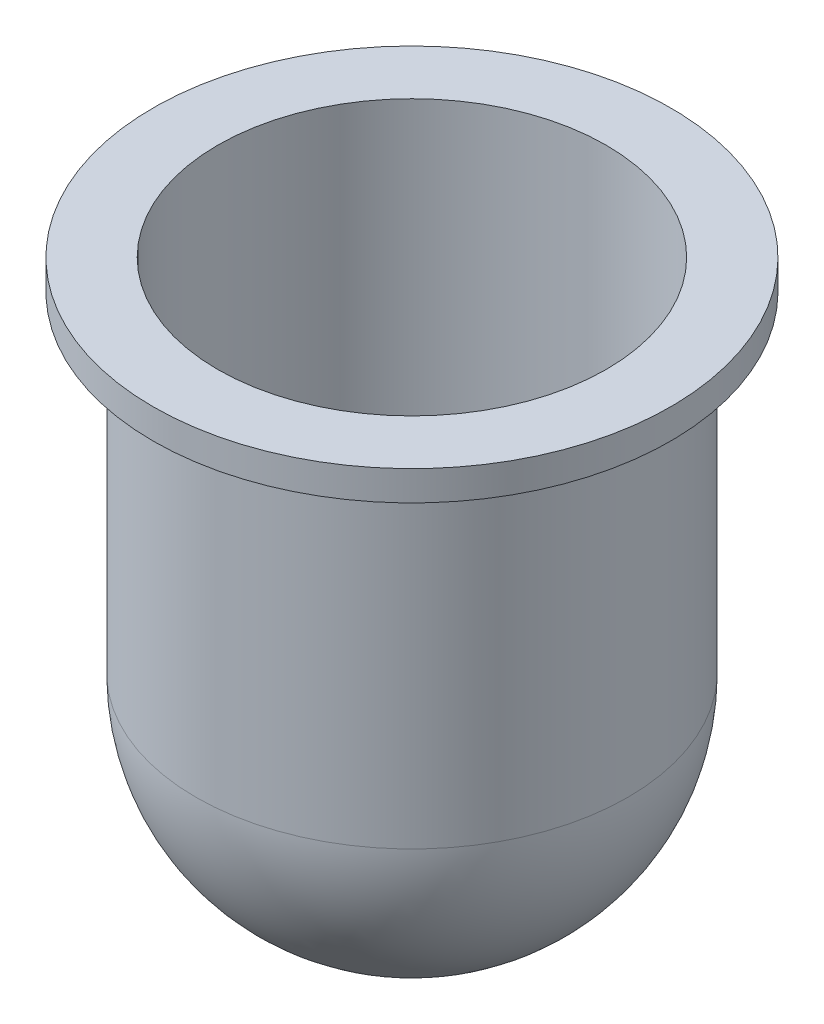
ISO-10303-21;
HEADER;
FILE_DESCRIPTION(('STEP AP214'),'2;1');
FILE_NAME('part.step','',(''),(''),'','','');
FILE_SCHEMA(('AUTOMOTIVE_DESIGN { 1 0 10303 214 1 1 1 1 }'));
ENDSEC;
DATA;
#1=APPLICATION_CONTEXT('core data for automotive mechanical design processes');
#2=APPLICATION_PROTOCOL_DEFINITION('international standard','automotive_design',2000,#1);
#3=PRODUCT_CONTEXT('',#1,'mechanical');
#4=PRODUCT('Part','Part','',(#3));
#5=PRODUCT_RELATED_PRODUCT_CATEGORY('part','',(#4));
#6=PRODUCT_DEFINITION_FORMATION('','',#4);
#7=PRODUCT_DEFINITION_CONTEXT('part definition',#1,'design');
#8=PRODUCT_DEFINITION('design','',#6,#7);
#9=PRODUCT_DEFINITION_SHAPE('','',#8);
#10=(LENGTH_UNIT() NAMED_UNIT(*) SI_UNIT(.MILLI.,.METRE.));
#11=(NAMED_UNIT(*) PLANE_ANGLE_UNIT() SI_UNIT($,.RADIAN.));
#12=(NAMED_UNIT(*) SI_UNIT($,.STERADIAN.) SOLID_ANGLE_UNIT());
#13=UNCERTAINTY_MEASURE_WITH_UNIT(LENGTH_MEASURE(1.E-05),#10,'distance_accuracy_value','');
#14=(GEOMETRIC_REPRESENTATION_CONTEXT(3) GLOBAL_UNCERTAINTY_ASSIGNED_CONTEXT((#13)) GLOBAL_UNIT_ASSIGNED_CONTEXT((#10,
#11,#12)) REPRESENTATION_CONTEXT('',''));
#15=CARTESIAN_POINT('',(0.,0.,0.));
#16=DIRECTION('',(0.,0.,1.));
#17=DIRECTION('',(1.,0.,0.));
#18=AXIS2_PLACEMENT_3D('',#15,#16,#17);
#19=CARTESIAN_POINT('',(0.,107.077522154684,0.));
#20=DIRECTION('',(0.,1.,0.));
#21=DIRECTION('',(0.,0.,1.));
#22=AXIS2_PLACEMENT_3D('',#19,#20,#21);
#23=CYLINDRICAL_SURFACE('',#22,17.9857628043161);
#24=CARTESIAN_POINT('',(0.,37.9355682328204,0.));
#25=DIRECTION('',(0.,1.,0.));
#26=DIRECTION('',(0.,0.,1.));
#27=AXIS2_PLACEMENT_3D('',#24,#25,#26);
#28=CIRCLE('',#27,17.9857628043161);
#29=CARTESIAN_POINT('',(0.,37.9355682328204,17.9857628043161));
#30=VERTEX_POINT('',#29);
#31=EDGE_CURVE('E40',#30,#30,#28,.T.);
#32=ORIENTED_EDGE('',*,*,#31,.T.);
#33=EDGE_LOOP('',(#32));
#34=FACE_BOUND('',#33,.T.);
#35=CARTESIAN_POINT('',(0.,40.,0.));
#36=DIRECTION('',(0.,1.,0.));
#37=DIRECTION('',(0.,0.,1.));
#38=AXIS2_PLACEMENT_3D('',#35,#36,#37);
#39=CIRCLE('',#38,17.9857628043161);
#40=CARTESIAN_POINT('',(0.,40.,17.9857628043161));
#41=VERTEX_POINT('',#40);
#42=EDGE_CURVE('E10',#41,#41,#39,.T.);
#43=ORIENTED_EDGE('',*,*,#42,.F.);
#44=EDGE_LOOP('',(#43));
#45=FACE_BOUND('',#44,.T.);
#46=ADVANCED_FACE('F34',(#34,#45),#23,.T.);
#47=CARTESIAN_POINT('',(-17.9857628043161,37.9355682328204,0.));
#48=DIRECTION('',(0.,-1.,0.));
#49=DIRECTION('',(0.,0.,-1.));
#50=AXIS2_PLACEMENT_3D('',#47,#48,#49);
#51=PLANE('',#50);
#52=CARTESIAN_POINT('',(0.,37.9355682328204,0.));
#53=DIRECTION('',(0.,1.,0.));
#54=DIRECTION('',(0.,0.,1.));
#55=AXIS2_PLACEMENT_3D('',#52,#53,#54);
#56=CIRCLE('',#55,15.);
#57=CARTESIAN_POINT('',(0.,37.9355682328204,15.));
#58=VERTEX_POINT('',#57);
#59=EDGE_CURVE('E44',#58,#58,#56,.T.);
#60=ORIENTED_EDGE('',*,*,#59,.T.);
#61=EDGE_LOOP('',(#60));
#62=FACE_BOUND('',#61,.T.);
#63=ORIENTED_EDGE('',*,*,#31,.F.);
#64=EDGE_LOOP('',(#63));
#65=FACE_BOUND('',#64,.T.);
#66=ADVANCED_FACE('F72',(#62,#65),#51,.T.);
#67=CARTESIAN_POINT('',(0.,107.077522154684,0.));
#68=DIRECTION('',(0.,1.,0.));
#69=DIRECTION('',(0.,0.,1.));
#70=AXIS2_PLACEMENT_3D('',#67,#68,#69);
#71=CYLINDRICAL_SURFACE('',#70,15.);
#72=CARTESIAN_POINT('',(0.,15.,0.));
#73=DIRECTION('',(0.,1.,0.));
#74=DIRECTION('',(0.,0.,1.));
#75=AXIS2_PLACEMENT_3D('',#72,#73,#74);
#76=CIRCLE('',#75,15.);
#77=CARTESIAN_POINT('',(0.,15.,15.));
#78=VERTEX_POINT('',#77);
#79=EDGE_CURVE('E48',#78,#78,#76,.T.);
#80=ORIENTED_EDGE('',*,*,#79,.T.);
#81=EDGE_LOOP('',(#80));
#82=FACE_BOUND('',#81,.T.);
#83=ORIENTED_EDGE('',*,*,#59,.F.);
#84=EDGE_LOOP('',(#83));
#85=FACE_BOUND('',#84,.T.);
#86=ADVANCED_FACE('F76',(#82,#85),#71,.T.);
#87=CARTESIAN_POINT('',(0.,15.,0.));
#88=DIRECTION('',(0.,1.,0.));
#89=DIRECTION('',(-1.,0.,0.));
#90=AXIS2_PLACEMENT_3D('',#87,#88,#89);
#91=SPHERICAL_SURFACE('',#90,15.);
#92=ORIENTED_EDGE('',*,*,#79,.F.);
#93=EDGE_LOOP('',(#92));
#94=FACE_BOUND('',#93,.T.);
#95=ADVANCED_FACE('F82',(#94),#91,.T.);
#96=CARTESIAN_POINT('',(0.,15.,0.));
#97=DIRECTION('',(0.,1.,0.));
#98=DIRECTION('',(-1.,0.,0.));
#99=AXIS2_PLACEMENT_3D('',#96,#97,#98);
#100=SPHERICAL_SURFACE('',#99,13.5);
#101=CARTESIAN_POINT('',(0.,15.,0.));
#102=DIRECTION('',(0.,1.,0.));
#103=DIRECTION('',(0.,0.,1.));
#104=AXIS2_PLACEMENT_3D('',#101,#102,#103);
#105=CIRCLE('',#104,13.5);
#106=CARTESIAN_POINT('',(0.,15.,13.5));
#107=VERTEX_POINT('',#106);
#108=EDGE_CURVE('E53',#107,#107,#105,.T.);
#109=ORIENTED_EDGE('',*,*,#108,.T.);
#110=EDGE_LOOP('',(#109));
#111=FACE_BOUND('',#110,.T.);
#112=ADVANCED_FACE('F69',(#111),#100,.F.);
#113=CARTESIAN_POINT('',(0.,107.077522154684,0.));
#114=DIRECTION('',(0.,1.,0.));
#115=DIRECTION('',(0.,0.,1.));
#116=AXIS2_PLACEMENT_3D('',#113,#114,#115);
#117=CYLINDRICAL_SURFACE('',#116,13.5);
#118=CARTESIAN_POINT('',(0.,40.,0.));
#119=DIRECTION('',(0.,1.,0.));
#120=DIRECTION('',(0.,0.,1.));
#121=AXIS2_PLACEMENT_3D('',#118,#119,#120);
#122=CIRCLE('',#121,13.5);
#123=CARTESIAN_POINT('',(0.,40.,13.5));
#124=VERTEX_POINT('',#123);
#125=EDGE_CURVE('E56',#124,#124,#122,.T.);
#126=ORIENTED_EDGE('',*,*,#125,.T.);
#127=EDGE_LOOP('',(#126));
#128=FACE_BOUND('',#127,.T.);
#129=ORIENTED_EDGE('',*,*,#108,.F.);
#130=EDGE_LOOP('',(#129));
#131=FACE_BOUND('',#130,.T.);
#132=ADVANCED_FACE('F60',(#128,#131),#117,.F.);
#133=CARTESIAN_POINT('',(-15.,40.,0.));
#134=DIRECTION('',(0.,1.,0.));
#135=DIRECTION('',(0.,0.,1.));
#136=AXIS2_PLACEMENT_3D('',#133,#134,#135);
#137=PLANE('',#136);
#138=ORIENTED_EDGE('',*,*,#42,.T.);
#139=EDGE_LOOP('',(#138));
#140=FACE_BOUND('',#139,.T.);
#141=ORIENTED_EDGE('',*,*,#125,.F.);
#142=EDGE_LOOP('',(#141));
#143=FACE_BOUND('',#142,.T.);
#144=ADVANCED_FACE('F63',(#140,#143),#137,.T.);
#145=CLOSED_SHELL('',(#46,#66,#86,#95,#112,#132,#144));
#146=MANIFOLD_SOLID_BREP('B2',#145);
#147=ADVANCED_BREP_SHAPE_REPRESENTATION('',(#18,#146),#14);
#148=SHAPE_DEFINITION_REPRESENTATION(#9,#147);
ENDSEC;
END-ISO-10303-21;
